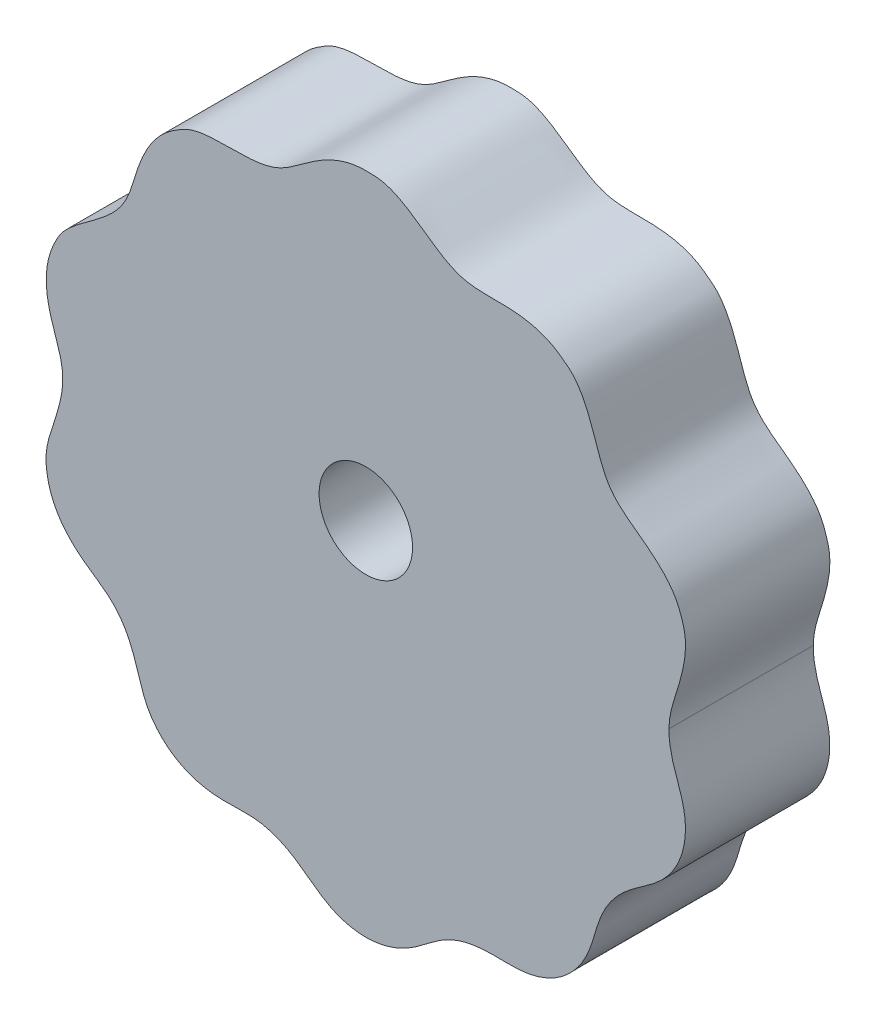
ISO-10303-21;
HEADER;
FILE_DESCRIPTION(('STEP AP214'),'2;1');
FILE_NAME('part.step','',(''),(''),'','','');
FILE_SCHEMA(('AUTOMOTIVE_DESIGN { 1 0 10303 214 1 1 1 1 }'));
ENDSEC;
DATA;
#1=APPLICATION_CONTEXT('core data for automotive mechanical design processes');
#2=APPLICATION_PROTOCOL_DEFINITION('international standard','automotive_design',2000,#1);
#3=PRODUCT_CONTEXT('',#1,'mechanical');
#4=PRODUCT('Part','Part','',(#3));
#5=PRODUCT_RELATED_PRODUCT_CATEGORY('part','',(#4));
#6=PRODUCT_DEFINITION_FORMATION('','',#4);
#7=PRODUCT_DEFINITION_CONTEXT('part definition',#1,'design');
#8=PRODUCT_DEFINITION('design','',#6,#7);
#9=PRODUCT_DEFINITION_SHAPE('','',#8);
#10=(LENGTH_UNIT() NAMED_UNIT(*) SI_UNIT(.MILLI.,.METRE.));
#11=(NAMED_UNIT(*) PLANE_ANGLE_UNIT() SI_UNIT($,.RADIAN.));
#12=(NAMED_UNIT(*) SI_UNIT($,.STERADIAN.) SOLID_ANGLE_UNIT());
#13=UNCERTAINTY_MEASURE_WITH_UNIT(LENGTH_MEASURE(1.E-05),#10,'distance_accuracy_value','');
#14=(GEOMETRIC_REPRESENTATION_CONTEXT(3) GLOBAL_UNCERTAINTY_ASSIGNED_CONTEXT((#13)) GLOBAL_UNIT_ASSIGNED_CONTEXT((#10,
#11,#12)) REPRESENTATION_CONTEXT('',''));
#15=CARTESIAN_POINT('',(0.,0.,0.));
#16=DIRECTION('',(0.,0.,1.));
#17=DIRECTION('',(1.,0.,0.));
#18=AXIS2_PLACEMENT_3D('',#15,#16,#17);
#19=CARTESIAN_POINT('',(10.5000259996595,0.0105000834515226,5.));
#20=CARTESIAN_POINT('',(10.5001048294199,0.0264184257585318,5.));
#21=CARTESIAN_POINT('',(10.5007115661272,0.0582796279955404,5.));
#22=CARTESIAN_POINT('',(10.503009847452,0.114829082964499,5.));
#23=CARTESIAN_POINT('',(10.5087266558851,0.196966447472672,5.));
#24=CARTESIAN_POINT('',(10.5189693942636,0.295241713894375,5.));
#25=CARTESIAN_POINT('',(10.535875912712,0.405252359812212,5.));
#26=CARTESIAN_POINT('',(10.5615068928391,0.534666033656944,5.));
#27=CARTESIAN_POINT('',(10.5970480353222,0.682169537704581,5.));
#28=CARTESIAN_POINT('',(10.637071722356,0.827718674558213,5.));
#29=CARTESIAN_POINT('',(10.6800310026894,0.97266306184544,5.));
#30=CARTESIAN_POINT('',(10.7274445083926,1.12625883134798,5.));
#31=CARTESIAN_POINT('',(10.7783138711307,1.28881359291302,5.));
#32=CARTESIAN_POINT('',(10.8452810600262,1.50605669667608,5.));
#33=CARTESIAN_POINT('',(10.9242169263714,1.77918003825524,5.));
#34=CARTESIAN_POINT('',(11.0034833416908,2.10149422087458,5.));
#35=CARTESIAN_POINT('',(11.059665237364,2.43794782268923,5.));
#36=CARTESIAN_POINT('',(11.0814061704677,2.740126659603,5.));
#37=CARTESIAN_POINT('',(11.0715444647144,3.00431645743637,5.));
#38=CARTESIAN_POINT('',(11.0423259466252,3.20017287851462,5.));
#39=CARTESIAN_POINT('',(10.9983006334228,3.36374619579446,5.));
#40=CARTESIAN_POINT('',(10.9549931989951,3.49969519652166,5.));
#41=CARTESIAN_POINT('',(10.9191141293276,3.61014213598758,5.));
#42=CARTESIAN_POINT('',(10.8715573399689,3.74992435729805,5.));
#43=CARTESIAN_POINT('',(10.8028004066191,3.91560573712742,5.));
#44=CARTESIAN_POINT('',(10.7025185554883,4.09954553117977,5.));
#45=CARTESIAN_POINT('',(10.5461982919032,4.32750446994615,5.));
#46=CARTESIAN_POINT('',(10.343492756728,4.56683822898761,5.));
#47=CARTESIAN_POINT('',(10.0928995847101,4.81252804378833,5.));
#48=CARTESIAN_POINT('',(9.79623736037879,5.06169317549239,5.));
#49=CARTESIAN_POINT('',(9.44621280555743,5.32521972184382,5.));
#50=CARTESIAN_POINT('',(9.05194058110651,5.60997660827454,5.));
#51=CARTESIAN_POINT('',(8.68178364823434,5.91045131674057,5.));
#52=CARTESIAN_POINT('',(8.40105629295879,6.28092654371785,5.));
#53=CARTESIAN_POINT('',(8.22504840437341,6.63668536191203,5.));
#54=CARTESIAN_POINT('',(8.10290343213784,6.94620990886774,5.));
#55=CARTESIAN_POINT('',(7.99258942601259,7.26708747322704,5.));
#56=CARTESIAN_POINT('',(7.88159602819585,7.59488197336541,5.));
#57=CARTESIAN_POINT('',(7.76208429352728,7.92707402768022,5.));
#58=CARTESIAN_POINT('',(7.62370441258603,8.25924599756008,5.));
#59=CARTESIAN_POINT('',(7.47598409902879,8.55008504502753,5.));
#60=CARTESIAN_POINT('',(7.3168917430591,8.79495709800448,5.));
#61=CARTESIAN_POINT('',(7.15075699998367,8.99259012708415,5.));
#62=CARTESIAN_POINT('',(6.98328212768019,9.14111616535054,5.));
#63=CARTESIAN_POINT('',(6.80096352962713,9.27316494508363,5.));
#64=CARTESIAN_POINT('',(6.61833420737676,9.40774236841796,5.));
#65=CARTESIAN_POINT('',(6.3701820366871,9.55199919624496,5.));
#66=CARTESIAN_POINT('',(6.06478435002615,9.67788061936099,5.));
#67=CARTESIAN_POINT('',(5.70529220739258,9.77421376805946,5.));
#68=CARTESIAN_POINT('',(5.19938794061724,9.84948356052572,5.));
#69=CARTESIAN_POINT('',(4.65933461420114,9.87105155349161,5.));
#70=CARTESIAN_POINT('',(4.07890017616407,9.85357197626514,5.));
#71=CARTESIAN_POINT('',(3.50769511887468,9.89146797717838,5.));
#72=CARTESIAN_POINT('',(3.07015388415277,10.0351228728835,5.));
#73=CARTESIAN_POINT('',(2.64233551915355,10.2613039325899,5.));
#74=CARTESIAN_POINT('',(2.21777097691001,10.5479718199286,5.));
#75=CARTESIAN_POINT('',(1.80559691949567,10.8489191657662,5.));
#76=CARTESIAN_POINT('',(1.37847650691224,11.1307221223136,5.));
#77=CARTESIAN_POINT('',(1.02895261922722,11.3143600856933,5.));
#78=CARTESIAN_POINT('',(0.769392125082659,11.4162119904844,5.));
#79=CARTESIAN_POINT('',(0.528662606047067,11.4748601520336,5.));
#80=CARTESIAN_POINT('',(0.34014591995296,11.4923695404451,5.));
#81=CARTESIAN_POINT('',(0.178359512638838,11.4972112806719,5.));
#82=CARTESIAN_POINT('',(-0.0429617310369814,11.5025644788609,5.));
#83=CARTESIAN_POINT('',(-0.324456478072367,11.493701175031,5.));
#84=CARTESIAN_POINT('',(-0.754292044081003,11.4130196976523,5.));
#85=CARTESIAN_POINT('',(-1.30408237440052,11.1953885983105,5.));
#86=CARTESIAN_POINT('',(-1.84510727051435,10.8684126506679,5.));
#87=CARTESIAN_POINT('',(-2.3154214165742,10.5077294014391,5.));
#88=CARTESIAN_POINT('',(-2.71439006190533,10.2221910949529,5.));
#89=CARTESIAN_POINT('',(-3.06142709543121,10.0444128262384,5.));
#90=CARTESIAN_POINT('',(-3.35879856974595,9.94321908037028,5.));
#91=CARTESIAN_POINT('',(-3.74659094320215,9.86644077148835,5.));
#92=CARTESIAN_POINT('',(-4.24547996185479,9.83079361294313,5.));
#93=CARTESIAN_POINT('',(-4.75633773051174,9.83201662349578,5.));
#94=CARTESIAN_POINT('',(-5.27937940035151,9.82646803235608,5.));
#95=CARTESIAN_POINT('',(-5.69625156808816,9.78507082016119,5.));
#96=CARTESIAN_POINT('',(-5.98072232981013,9.72423703691899,5.));
#97=CARTESIAN_POINT('',(-6.21911680480913,9.63688994246106,5.));
#98=CARTESIAN_POINT('',(-6.40980268059581,9.53454116820386,5.));
#99=CARTESIAN_POINT('',(-6.59481071128278,9.41793080804636,5.));
#100=CARTESIAN_POINT('',(-6.7788070713599,9.29439097949949,5.));
#101=CARTESIAN_POINT('',(-6.99845193961731,9.11855241958439,5.));
#102=CARTESIAN_POINT('',(-7.26871376451952,8.8429109964273,5.));
#103=CARTESIAN_POINT('',(-7.55097534046629,8.44438575442727,5.));
#104=CARTESIAN_POINT('',(-7.81120251451606,7.90564614714792,5.));
#105=CARTESIAN_POINT('',(-7.98542568122687,7.36702401313024,5.));
#106=CARTESIAN_POINT('',(-8.12294371754769,6.89574141503751,5.));
#107=CARTESIAN_POINT('',(-8.2995662473298,6.46017283042775,5.));
#108=CARTESIAN_POINT('',(-8.53330223519762,6.08599948661898,5.));
#109=CARTESIAN_POINT('',(-8.84962275404447,5.75571507779687,5.));
#110=CARTESIAN_POINT('',(-9.2127459304404,5.45572406750674,5.));
#111=CARTESIAN_POINT('',(-9.56341476660639,5.19774278715688,5.));
#112=CARTESIAN_POINT('',(-9.88734150413978,4.96454947703263,5.));
#113=CARTESIAN_POINT('',(-10.2046436337999,4.71739597905755,5.));
#114=CARTESIAN_POINT('',(-10.4609987089737,4.47150140369236,5.));
#115=CARTESIAN_POINT('',(-10.6409570911345,4.22261338066336,5.));
#116=CARTESIAN_POINT('',(-10.7625198762939,3.9870138069379,5.));
#117=CARTESIAN_POINT('',(-10.8540650528386,3.78533971053623,5.));
#118=CARTESIAN_POINT('',(-10.9574234358809,3.51536328931377,5.));
#119=CARTESIAN_POINT('',(-11.0466057804634,3.1605986725257,5.));
#120=CARTESIAN_POINT('',(-11.0859429705711,2.72771722316399,5.));
#121=CARTESIAN_POINT('',(-11.0511748216308,2.2533495112549,5.));
#122=CARTESIAN_POINT('',(-10.9584099154489,1.8059065254275,5.));
#123=CARTESIAN_POINT('',(-10.8323356414937,1.39499290777946,5.));
#124=CARTESIAN_POINT('',(-10.6969308729277,1.01511088296022,5.));
#125=CARTESIAN_POINT('',(-10.5654138543342,0.615645480809583,5.));
#126=CARTESIAN_POINT('',(-10.4874586369524,0.181998824013859,5.));
#127=CARTESIAN_POINT('',(-10.5017249670691,-0.379724647290651,5.));
#128=CARTESIAN_POINT('',(-10.6531601083947,-1.04644692357243,5.));
#129=CARTESIAN_POINT('',(-10.8665109647804,-1.62788010629204,5.));
#130=CARTESIAN_POINT('',(-11.0344578293952,-2.16585928512982,5.));
#131=CARTESIAN_POINT('',(-11.0808837998222,-2.56344944229804,5.));
#132=CARTESIAN_POINT('',(-11.0801044342768,-2.79968846902725,5.));
#133=CARTESIAN_POINT('',(-11.0504186502972,-3.09364839956221,5.));
#134=CARTESIAN_POINT('',(-10.9840439591602,-3.44226287640831,5.));
#135=CARTESIAN_POINT('',(-10.848306380665,-3.83136925325631,5.));
#136=CARTESIAN_POINT('',(-10.6193998269797,-4.23881049803247,5.));
#137=CARTESIAN_POINT('',(-10.3410514120845,-4.59155082075995,5.));
#138=CARTESIAN_POINT('',(-10.0316166764077,-4.89206975591219,5.));
#139=CARTESIAN_POINT('',(-9.70400785366773,-5.1498266174014,5.));
#140=CARTESIAN_POINT('',(-9.37220778498275,-5.37803912109795,5.));
#141=CARTESIAN_POINT('',(-9.02915624264273,-5.61373901024372,5.));
#142=CARTESIAN_POINT('',(-8.70189549052895,-5.89614388529793,5.));
#143=CARTESIAN_POINT('',(-8.36819044889937,-6.31601103316079,5.));
#144=CARTESIAN_POINT('',(-8.07978936113426,-6.88823975079273,5.));
#145=CARTESIAN_POINT('',(-7.90541657303611,-7.44559019638691,5.));
#146=CARTESIAN_POINT('',(-7.75542004256456,-7.95456682894558,5.));
#147=CARTESIAN_POINT('',(-7.60272157871748,-8.31234244069944,5.));
#148=CARTESIAN_POINT('',(-7.48485274292157,-8.52870344081869,5.));
#149=CARTESIAN_POINT('',(-7.31473465607675,-8.77520050890113,5.));
#150=CARTESIAN_POINT('',(-7.08419857100512,-9.04231206036892,5.));
#151=CARTESIAN_POINT('',(-6.69171461448847,-9.38661042288974,5.));
#152=CARTESIAN_POINT('',(-6.12732970079235,-9.68591163590114,5.));
#153=CARTESIAN_POINT('',(-5.45023591658135,-9.85482864633477,5.));
#154=CARTESIAN_POINT('',(-4.73482529085109,-9.87289087569385,5.));
#155=CARTESIAN_POINT('',(-4.11593595487789,-9.83076711279388,5.));
#156=CARTESIAN_POINT('',(-3.51908667514989,-9.88516944732904,5.));
#157=CARTESIAN_POINT('',(-2.97491691287754,-10.0649054774183,5.));
#158=CARTESIAN_POINT('',(-2.44557515688871,-10.3541019586843,5.));
#159=CARTESIAN_POINT('',(-1.93885438391421,-10.7311499315236,5.));
#160=CARTESIAN_POINT('',(-1.37354590292759,-11.1697743017267,5.));
#161=CARTESIAN_POINT('',(-0.629008992321922,-11.4829250848612,5.));
#162=CARTESIAN_POINT('',(0.245211841616288,-11.5559245151699,5.));
#163=CARTESIAN_POINT('',(1.11206725264796,-11.3245067890969,5.));
#164=CARTESIAN_POINT('',(1.83402671936433,-10.8829881747148,5.));
#165=CARTESIAN_POINT('',(2.37986416168733,-10.4062875399064,5.));
#166=CARTESIAN_POINT('',(2.90457515845031,-10.0946404728535,5.));
#167=CARTESIAN_POINT('',(3.49117211320051,-9.89596820554772,5.));
#168=CARTESIAN_POINT('',(4.11876534796051,-9.80338954604728,5.));
#169=CARTESIAN_POINT('',(4.74930605962909,-9.829396226919,5.));
#170=CARTESIAN_POINT('',(5.38229403379887,-9.83313511436207,5.));
#171=CARTESIAN_POINT('',(5.92168923219119,-9.7278437683662,5.));
#172=CARTESIAN_POINT('',(6.35413654265242,-9.56537408644923,5.));
#173=CARTESIAN_POINT('',(6.86573086261321,-9.26171742902622,5.));
#174=CARTESIAN_POINT('',(7.27890111917769,-8.86111406524538,5.));
#175=CARTESIAN_POINT('',(7.5813752234123,-8.39929632658292,5.));
#176=CARTESIAN_POINT('',(7.78467509618198,-7.91479490993791,5.));
#177=CARTESIAN_POINT('',(7.8970874527581,-7.56153358981202,5.));
#178=CARTESIAN_POINT('',(8.00711411353118,-7.16643871560516,5.));
#179=CARTESIAN_POINT('',(8.1533795000661,-6.73982462484788,5.));
#180=CARTESIAN_POINT('',(8.39610033246734,-6.27314254916155,5.));
#181=CARTESIAN_POINT('',(8.77169404772501,-5.80595336710727,5.));
#182=CARTESIAN_POINT('',(9.25314422153011,-5.39936208435424,5.));
#183=CARTESIAN_POINT('',(9.80579363599765,-5.04469075652925,5.));
#184=CARTESIAN_POINT('',(10.2889400003648,-4.65797891269276,5.));
#185=CARTESIAN_POINT('',(10.650092312287,-4.20542427395497,5.));
#186=CARTESIAN_POINT('',(10.8944344794551,-3.72812650933997,5.));
#187=CARTESIAN_POINT('',(11.0354291688477,-3.2514203366136,5.));
#188=CARTESIAN_POINT('',(11.0843024192694,-2.79427661401115,5.));
#189=CARTESIAN_POINT('',(11.0606530006441,-2.37192664674445,5.));
#190=CARTESIAN_POINT('',(10.9875285819416,-1.99342066414433,5.));
#191=CARTESIAN_POINT('',(10.9000475752562,-1.70082183745389,5.));
#192=CARTESIAN_POINT('',(10.8136589831162,-1.45422268609148,5.));
#193=CARTESIAN_POINT('',(10.7431701780615,-1.25479087986251,5.));
#194=CARTESIAN_POINT('',(10.6913482419793,-1.10176818552672,5.));
#195=CARTESIAN_POINT('',(10.6451900880009,-0.95351394516553,5.));
#196=CARTESIAN_POINT('',(10.6054107183801,-0.810029760826601,5.));
#197=CARTESIAN_POINT('',(10.5710639363577,-0.665080630960173,5.));
#198=CARTESIAN_POINT('',(10.5428522290195,-0.519055196821209,5.));
#199=CARTESIAN_POINT('',(10.521287099145,-0.369796581525494,5.));
#200=CARTESIAN_POINT('',(10.5067243799115,-0.231657261759564,5.));
#201=CARTESIAN_POINT('',(10.5012226113992,-0.0928702614832248,5.));
#202=CARTESIAN_POINT('',(10.500000000005,-0.0313625493271181,5.));
#203=CARTESIAN_POINT('',(10.5,0.,5.));
#204=B_SPLINE_CURVE_WITH_KNOTS('',4,(#19,#20,#21,#22,#23,#24,#25,#26,#27,#28,#29,#30,#31,#32,
#33,#34,#35,#36,#37,#38,#39,#40,#41,#42,#43,#44,#45,#46,#47,#48,#49,#50,#51,#52,#53,#54,#55,#56,
#57,#58,#59,#60,#61,#62,#63,#64,#65,#66,#67,#68,#69,#70,#71,#72,#73,#74,#75,#76,#77,#78,#79,#80,
#81,#82,#83,#84,#85,#86,#87,#88,#89,#90,#91,#92,#93,#94,#95,#96,#97,#98,#99,#100,#101,#102,#103,
#104,#105,#106,#107,#108,#109,#110,#111,#112,#113,#114,#115,#116,#117,#118,#119,#120,#121,#122,
#123,#124,#125,#126,#127,#128,#129,#130,#131,#132,#133,#134,#135,#136,#137,#138,#139,#140,#141,
#142,#143,#144,#145,#146,#147,#148,#149,#150,#151,#152,#153,#154,#155,#156,#157,#158,#159,#160,
#161,#162,#163,#164,#165,#166,#167,#168,#169,#170,#171,#172,#173,#174,#175,#176,#177,#178,#179,
#180,#181,#182,#183,#184,#185,#186,#187,#188,#189,#190,#191,#192,#193,#194,#195,#196,#197,#198,
#199,#200,#201,#202,#203),.UNSPECIFIED.,.F.,.F.,(5,1,1,1,1,1,1,1,1,1,1,1,1,1,1,1,1,1,1,1,1,1,1,
1,1,1,1,1,1,1,1,1,1,1,1,1,1,1,1,1,1,1,1,1,1,1,1,1,1,1,1,1,1,1,1,1,1,1,1,1,1,1,1,1,1,1,1,1,1,1,1,
1,1,1,1,1,1,1,1,1,1,1,1,1,1,1,1,1,1,1,1,1,1,1,1,1,1,1,1,1,1,1,1,1,1,1,1,1,1,1,1,1,1,1,1,1,1,1,1,
1,1,1,1,1,1,1,1,1,1,1,1,1,1,1,1,1,1,1,1,1,1,1,1,1,1,1,1,1,1,1,1,1,1,1,1,1,1,1,1,1,1,1,1,1,1,1,1,
1,1,1,1,1,1,1,1,1,1,1,1,1,1,5),(0.0793096471965865,0.0801840078519034,0.0810583685072204,
0.0819327291625374,0.0828070898178544,0.0845558111284884,0.0863045324391222,0.0880532537497561,
0.08980197506039,0.091550696371024,0.0932994176816579,0.0954922862449255,0.097685154808193,
0.102070891934728,0.106456629061263,0.110842366187798,0.1134528665288,0.116063366869802,
0.118673867210805,0.119979117381306,0.121284367551807,0.122666170803665,0.124047974055523,
0.126811580559239,0.129575187062956,0.132338793566672,0.136821690238761,0.141304586910849,
0.145787483582938,0.150270380255026,0.157068298119175,0.163866215983324,0.167713182045455,
0.171560148107586,0.175407114169717,0.179254080231848,0.183416060455022,0.187578040678196,
0.19174002090137,0.195902001124544,0.198484694416269,0.201067387707995,0.203650080999721,
0.206232774291446,0.208898704840493,0.211564635389539,0.216896496487632,0.221477990084626,
0.226059483681619,0.235222470875606,0.241823189006553,0.248423907137499,0.252369343388726,
0.256314779639952,0.264205652142405,0.272081186187557,0.276018953210133,0.279956720232708,
0.282453785675091,0.284950851117474,0.287447916559857,0.288696449281048,0.289944982002239,
0.29519902196316,0.30045306192408,0.308810020919703,0.317166979915325,0.324322238053648,
0.327899867122809,0.33147749619197,0.335145691590727,0.338813886989483,0.346150277786996,
0.354579479440329,0.358794080266995,0.363008681093661,0.365507178533993,0.368005675974324,
0.370504173414655,0.373002670854987,0.375629068898513,0.378255466942039,0.383508263029091,
0.390809411087853,0.398110559146615,0.405820466801723,0.409675420629276,0.41353037445683,
0.419811047176839,0.426091719896848,0.430710159306556,0.435328598716264,0.439947038125972,
0.44456547753568,0.449320342187237,0.451697774513016,0.454075206838794,0.456821901527323,
0.459568596215852,0.465061985592909,0.470947020399799,0.47683205520669,0.481497332532875,
0.486162609859061,0.490827887185247,0.495493164511433,0.500956919380529,0.506420674249625,
0.516680840291959,0.526941006334293,0.529671413407083,0.532401820479873,0.535132227552664,
0.537862634625454,0.543328067790379,0.548793500955304,0.554093022828657,0.55939254470201,
0.564050002710673,0.568707460719335,0.573364918727998,0.578022376736661,0.583319705602784,
0.588617034468908,0.598042827583762,0.607468620698616,0.610315284520545,0.613161948342474,
0.616008612164403,0.618855275986332,0.624153882704927,0.629452489423521,0.640052642610628,
0.648073718245131,0.656094793879635,0.662434429523122,0.668774065166609,0.675597492173606,
0.682420919180603,0.690216423426888,0.698011927673173,0.708607382503868,0.719206807237305,
0.730043259074116,0.738735856846142,0.747428454618168,0.752729675019228,0.758030895420288,
0.767294888712387,0.776558882004487,0.781908844121373,0.787258806238259,0.792559144685614,
0.797859483132969,0.809288293719841,0.813572906191479,0.817857518663117,0.822142131134755,
0.826426743606393,0.832560485571829,0.838694227537266,0.846342809438349,0.853991391339431,
0.861551631881865,0.8691118724243,0.874826493973346,0.880541115522393,0.88625545251835,
0.891969789514307,0.896002035658355,0.900034281802403,0.90406652794645,0.906082651018475,
0.908098774090498,0.909821431018298,0.911544087946097,0.913266744873896,0.914989401801695,
0.916712058729494,0.918434715657293,0.920157372585092,0.921880029512891),.UNSPECIFIED.);
#205=DIRECTION('',(0.,0.,-1.));
#206=VECTOR('',#205,1.);
#207=SURFACE_OF_LINEAR_EXTRUSION('',#204,#206);
#208=CARTESIAN_POINT('',(10.5000259996595,0.0105000834515226,0.));
#209=CARTESIAN_POINT('',(10.5001048294199,0.0264184257585318,0.));
#210=CARTESIAN_POINT('',(10.5007115661272,0.0582796279955404,0.));
#211=CARTESIAN_POINT('',(10.503009847452,0.114829082964499,0.));
#212=CARTESIAN_POINT('',(10.5087266558851,0.196966447472672,0.));
#213=CARTESIAN_POINT('',(10.5189693942636,0.295241713894375,0.));
#214=CARTESIAN_POINT('',(10.535875912712,0.405252359812212,0.));
#215=CARTESIAN_POINT('',(10.5615068928391,0.534666033656944,0.));
#216=CARTESIAN_POINT('',(10.5970480353222,0.682169537704581,0.));
#217=CARTESIAN_POINT('',(10.637071722356,0.827718674558213,0.));
#218=CARTESIAN_POINT('',(10.6800310026894,0.97266306184544,0.));
#219=CARTESIAN_POINT('',(10.7274445083926,1.12625883134798,0.));
#220=CARTESIAN_POINT('',(10.7783138711307,1.28881359291302,0.));
#221=CARTESIAN_POINT('',(10.8452810600262,1.50605669667608,0.));
#222=CARTESIAN_POINT('',(10.9242169263714,1.77918003825524,0.));
#223=CARTESIAN_POINT('',(11.0034833416908,2.10149422087458,0.));
#224=CARTESIAN_POINT('',(11.059665237364,2.43794782268923,0.));
#225=CARTESIAN_POINT('',(11.0814061704677,2.740126659603,0.));
#226=CARTESIAN_POINT('',(11.0715444647144,3.00431645743637,0.));
#227=CARTESIAN_POINT('',(11.0423259466252,3.20017287851462,0.));
#228=CARTESIAN_POINT('',(10.9983006334228,3.36374619579446,0.));
#229=CARTESIAN_POINT('',(10.9549931989951,3.49969519652166,0.));
#230=CARTESIAN_POINT('',(10.9191141293276,3.61014213598758,0.));
#231=CARTESIAN_POINT('',(10.8715573399689,3.74992435729805,0.));
#232=CARTESIAN_POINT('',(10.8028004066191,3.91560573712742,0.));
#233=CARTESIAN_POINT('',(10.7025185554883,4.09954553117977,0.));
#234=CARTESIAN_POINT('',(10.5461982919032,4.32750446994615,0.));
#235=CARTESIAN_POINT('',(10.343492756728,4.56683822898761,0.));
#236=CARTESIAN_POINT('',(10.0928995847101,4.81252804378833,0.));
#237=CARTESIAN_POINT('',(9.79623736037879,5.06169317549239,0.));
#238=CARTESIAN_POINT('',(9.44621280555743,5.32521972184382,0.));
#239=CARTESIAN_POINT('',(9.05194058110651,5.60997660827454,0.));
#240=CARTESIAN_POINT('',(8.68178364823434,5.91045131674057,0.));
#241=CARTESIAN_POINT('',(8.40105629295879,6.28092654371785,0.));
#242=CARTESIAN_POINT('',(8.22504840437341,6.63668536191203,0.));
#243=CARTESIAN_POINT('',(8.10290343213784,6.94620990886774,0.));
#244=CARTESIAN_POINT('',(7.99258942601259,7.26708747322704,0.));
#245=CARTESIAN_POINT('',(7.88159602819585,7.59488197336541,0.));
#246=CARTESIAN_POINT('',(7.76208429352728,7.92707402768022,0.));
#247=CARTESIAN_POINT('',(7.62370441258603,8.25924599756008,0.));
#248=CARTESIAN_POINT('',(7.47598409902879,8.55008504502753,0.));
#249=CARTESIAN_POINT('',(7.3168917430591,8.79495709800448,0.));
#250=CARTESIAN_POINT('',(7.15075699998367,8.99259012708415,0.));
#251=CARTESIAN_POINT('',(6.98328212768019,9.14111616535054,0.));
#252=CARTESIAN_POINT('',(6.80096352962713,9.27316494508363,0.));
#253=CARTESIAN_POINT('',(6.61833420737676,9.40774236841796,0.));
#254=CARTESIAN_POINT('',(6.3701820366871,9.55199919624496,0.));
#255=CARTESIAN_POINT('',(6.06478435002615,9.67788061936099,0.));
#256=CARTESIAN_POINT('',(5.70529220739258,9.77421376805946,0.));
#257=CARTESIAN_POINT('',(5.19938794061724,9.84948356052572,0.));
#258=CARTESIAN_POINT('',(4.65933461420114,9.87105155349161,0.));
#259=CARTESIAN_POINT('',(4.07890017616407,9.85357197626514,0.));
#260=CARTESIAN_POINT('',(3.50769511887468,9.89146797717838,0.));
#261=CARTESIAN_POINT('',(3.07015388415277,10.0351228728835,0.));
#262=CARTESIAN_POINT('',(2.64233551915355,10.2613039325899,0.));
#263=CARTESIAN_POINT('',(2.21777097691001,10.5479718199286,0.));
#264=CARTESIAN_POINT('',(1.80559691949567,10.8489191657662,0.));
#265=CARTESIAN_POINT('',(1.37847650691224,11.1307221223136,0.));
#266=CARTESIAN_POINT('',(1.02895261922722,11.3143600856933,0.));
#267=CARTESIAN_POINT('',(0.769392125082659,11.4162119904844,0.));
#268=CARTESIAN_POINT('',(0.528662606047067,11.4748601520336,0.));
#269=CARTESIAN_POINT('',(0.34014591995296,11.4923695404451,0.));
#270=CARTESIAN_POINT('',(0.178359512638838,11.4972112806719,0.));
#271=CARTESIAN_POINT('',(-0.0429617310369814,11.5025644788609,0.));
#272=CARTESIAN_POINT('',(-0.324456478072367,11.493701175031,0.));
#273=CARTESIAN_POINT('',(-0.754292044081003,11.4130196976523,0.));
#274=CARTESIAN_POINT('',(-1.30408237440052,11.1953885983105,0.));
#275=CARTESIAN_POINT('',(-1.84510727051435,10.8684126506679,0.));
#276=CARTESIAN_POINT('',(-2.3154214165742,10.5077294014391,0.));
#277=CARTESIAN_POINT('',(-2.71439006190533,10.2221910949529,0.));
#278=CARTESIAN_POINT('',(-3.06142709543121,10.0444128262384,0.));
#279=CARTESIAN_POINT('',(-3.35879856974595,9.94321908037028,0.));
#280=CARTESIAN_POINT('',(-3.74659094320215,9.86644077148835,0.));
#281=CARTESIAN_POINT('',(-4.24547996185479,9.83079361294313,0.));
#282=CARTESIAN_POINT('',(-4.75633773051174,9.83201662349578,0.));
#283=CARTESIAN_POINT('',(-5.27937940035151,9.82646803235608,0.));
#284=CARTESIAN_POINT('',(-5.69625156808816,9.78507082016119,0.));
#285=CARTESIAN_POINT('',(-5.98072232981013,9.72423703691899,0.));
#286=CARTESIAN_POINT('',(-6.21911680480913,9.63688994246106,0.));
#287=CARTESIAN_POINT('',(-6.40980268059581,9.53454116820386,0.));
#288=CARTESIAN_POINT('',(-6.59481071128278,9.41793080804636,0.));
#289=CARTESIAN_POINT('',(-6.7788070713599,9.29439097949949,0.));
#290=CARTESIAN_POINT('',(-6.99845193961731,9.11855241958439,0.));
#291=CARTESIAN_POINT('',(-7.26871376451952,8.8429109964273,0.));
#292=CARTESIAN_POINT('',(-7.55097534046629,8.44438575442727,0.));
#293=CARTESIAN_POINT('',(-7.81120251451606,7.90564614714792,0.));
#294=CARTESIAN_POINT('',(-7.98542568122687,7.36702401313024,0.));
#295=CARTESIAN_POINT('',(-8.12294371754769,6.89574141503751,0.));
#296=CARTESIAN_POINT('',(-8.2995662473298,6.46017283042775,0.));
#297=CARTESIAN_POINT('',(-8.53330223519762,6.08599948661898,0.));
#298=CARTESIAN_POINT('',(-8.84962275404447,5.75571507779687,0.));
#299=CARTESIAN_POINT('',(-9.2127459304404,5.45572406750674,0.));
#300=CARTESIAN_POINT('',(-9.56341476660639,5.19774278715688,0.));
#301=CARTESIAN_POINT('',(-9.88734150413978,4.96454947703263,0.));
#302=CARTESIAN_POINT('',(-10.2046436337999,4.71739597905755,0.));
#303=CARTESIAN_POINT('',(-10.4609987089737,4.47150140369236,0.));
#304=CARTESIAN_POINT('',(-10.6409570911345,4.22261338066336,0.));
#305=CARTESIAN_POINT('',(-10.7625198762939,3.9870138069379,0.));
#306=CARTESIAN_POINT('',(-10.8540650528386,3.78533971053623,0.));
#307=CARTESIAN_POINT('',(-10.9574234358809,3.51536328931377,0.));
#308=CARTESIAN_POINT('',(-11.0466057804634,3.1605986725257,0.));
#309=CARTESIAN_POINT('',(-11.0859429705711,2.72771722316399,0.));
#310=CARTESIAN_POINT('',(-11.0511748216308,2.2533495112549,0.));
#311=CARTESIAN_POINT('',(-10.9584099154489,1.8059065254275,0.));
#312=CARTESIAN_POINT('',(-10.8323356414937,1.39499290777946,0.));
#313=CARTESIAN_POINT('',(-10.6969308729277,1.01511088296022,0.));
#314=CARTESIAN_POINT('',(-10.5654138543342,0.615645480809583,0.));
#315=CARTESIAN_POINT('',(-10.4874586369524,0.181998824013859,0.));
#316=CARTESIAN_POINT('',(-10.5017249670691,-0.379724647290651,0.));
#317=CARTESIAN_POINT('',(-10.6531601083947,-1.04644692357243,0.));
#318=CARTESIAN_POINT('',(-10.8665109647804,-1.62788010629204,0.));
#319=CARTESIAN_POINT('',(-11.0344578293952,-2.16585928512982,0.));
#320=CARTESIAN_POINT('',(-11.0808837998222,-2.56344944229804,0.));
#321=CARTESIAN_POINT('',(-11.0801044342768,-2.79968846902725,0.));
#322=CARTESIAN_POINT('',(-11.0504186502972,-3.09364839956221,0.));
#323=CARTESIAN_POINT('',(-10.9840439591602,-3.44226287640831,0.));
#324=CARTESIAN_POINT('',(-10.848306380665,-3.83136925325631,0.));
#325=CARTESIAN_POINT('',(-10.6193998269797,-4.23881049803247,0.));
#326=CARTESIAN_POINT('',(-10.3410514120845,-4.59155082075995,0.));
#327=CARTESIAN_POINT('',(-10.0316166764077,-4.89206975591219,0.));
#328=CARTESIAN_POINT('',(-9.70400785366773,-5.1498266174014,0.));
#329=CARTESIAN_POINT('',(-9.37220778498275,-5.37803912109795,0.));
#330=CARTESIAN_POINT('',(-9.02915624264273,-5.61373901024372,0.));
#331=CARTESIAN_POINT('',(-8.70189549052895,-5.89614388529793,0.));
#332=CARTESIAN_POINT('',(-8.36819044889937,-6.31601103316079,0.));
#333=CARTESIAN_POINT('',(-8.07978936113426,-6.88823975079273,0.));
#334=CARTESIAN_POINT('',(-7.90541657303611,-7.44559019638691,0.));
#335=CARTESIAN_POINT('',(-7.75542004256456,-7.95456682894558,0.));
#336=CARTESIAN_POINT('',(-7.60272157871748,-8.31234244069944,0.));
#337=CARTESIAN_POINT('',(-7.48485274292157,-8.52870344081869,0.));
#338=CARTESIAN_POINT('',(-7.31473465607675,-8.77520050890113,0.));
#339=CARTESIAN_POINT('',(-7.08419857100512,-9.04231206036892,0.));
#340=CARTESIAN_POINT('',(-6.69171461448847,-9.38661042288974,0.));
#341=CARTESIAN_POINT('',(-6.12732970079235,-9.68591163590114,0.));
#342=CARTESIAN_POINT('',(-5.45023591658135,-9.85482864633477,0.));
#343=CARTESIAN_POINT('',(-4.73482529085109,-9.87289087569385,0.));
#344=CARTESIAN_POINT('',(-4.11593595487789,-9.83076711279388,0.));
#345=CARTESIAN_POINT('',(-3.51908667514989,-9.88516944732904,0.));
#346=CARTESIAN_POINT('',(-2.97491691287754,-10.0649054774183,0.));
#347=CARTESIAN_POINT('',(-2.44557515688871,-10.3541019586843,0.));
#348=CARTESIAN_POINT('',(-1.93885438391421,-10.7311499315236,0.));
#349=CARTESIAN_POINT('',(-1.37354590292759,-11.1697743017267,0.));
#350=CARTESIAN_POINT('',(-0.629008992321922,-11.4829250848612,0.));
#351=CARTESIAN_POINT('',(0.245211841616288,-11.5559245151699,0.));
#352=CARTESIAN_POINT('',(1.11206725264796,-11.3245067890969,0.));
#353=CARTESIAN_POINT('',(1.83402671936433,-10.8829881747148,0.));
#354=CARTESIAN_POINT('',(2.37986416168733,-10.4062875399064,0.));
#355=CARTESIAN_POINT('',(2.90457515845031,-10.0946404728535,0.));
#356=CARTESIAN_POINT('',(3.49117211320051,-9.89596820554772,0.));
#357=CARTESIAN_POINT('',(4.11876534796051,-9.80338954604728,0.));
#358=CARTESIAN_POINT('',(4.74930605962909,-9.829396226919,0.));
#359=CARTESIAN_POINT('',(5.38229403379887,-9.83313511436207,0.));
#360=CARTESIAN_POINT('',(5.92168923219119,-9.7278437683662,0.));
#361=CARTESIAN_POINT('',(6.35413654265242,-9.56537408644923,0.));
#362=CARTESIAN_POINT('',(6.86573086261321,-9.26171742902622,0.));
#363=CARTESIAN_POINT('',(7.27890111917769,-8.86111406524538,0.));
#364=CARTESIAN_POINT('',(7.5813752234123,-8.39929632658292,0.));
#365=CARTESIAN_POINT('',(7.78467509618198,-7.91479490993791,0.));
#366=CARTESIAN_POINT('',(7.8970874527581,-7.56153358981202,0.));
#367=CARTESIAN_POINT('',(8.00711411353118,-7.16643871560516,0.));
#368=CARTESIAN_POINT('',(8.1533795000661,-6.73982462484788,0.));
#369=CARTESIAN_POINT('',(8.39610033246734,-6.27314254916155,0.));
#370=CARTESIAN_POINT('',(8.77169404772501,-5.80595336710727,0.));
#371=CARTESIAN_POINT('',(9.25314422153011,-5.39936208435424,0.));
#372=CARTESIAN_POINT('',(9.80579363599765,-5.04469075652925,0.));
#373=CARTESIAN_POINT('',(10.2889400003648,-4.65797891269276,0.));
#374=CARTESIAN_POINT('',(10.650092312287,-4.20542427395497,0.));
#375=CARTESIAN_POINT('',(10.8944344794551,-3.72812650933997,0.));
#376=CARTESIAN_POINT('',(11.0354291688477,-3.2514203366136,0.));
#377=CARTESIAN_POINT('',(11.0843024192694,-2.79427661401115,0.));
#378=CARTESIAN_POINT('',(11.0606530006441,-2.37192664674445,0.));
#379=CARTESIAN_POINT('',(10.9875285819416,-1.99342066414433,0.));
#380=CARTESIAN_POINT('',(10.9000475752562,-1.70082183745389,0.));
#381=CARTESIAN_POINT('',(10.8136589831162,-1.45422268609148,0.));
#382=CARTESIAN_POINT('',(10.7431701780615,-1.25479087986251,0.));
#383=CARTESIAN_POINT('',(10.6913482419793,-1.10176818552672,0.));
#384=CARTESIAN_POINT('',(10.6451900880009,-0.95351394516553,0.));
#385=CARTESIAN_POINT('',(10.6054107183801,-0.810029760826601,0.));
#386=CARTESIAN_POINT('',(10.5710639363577,-0.665080630960173,0.));
#387=CARTESIAN_POINT('',(10.5428522290195,-0.519055196821209,0.));
#388=CARTESIAN_POINT('',(10.521287099145,-0.369796581525494,0.));
#389=CARTESIAN_POINT('',(10.5067243799115,-0.231657261759564,0.));
#390=CARTESIAN_POINT('',(10.5012226113992,-0.0928702614832248,0.));
#391=CARTESIAN_POINT('',(10.500000000005,-0.0313625493271181,0.));
#392=CARTESIAN_POINT('',(10.5,0.,0.));
#393=B_SPLINE_CURVE_WITH_KNOTS('',4,(#208,#209,#210,#211,#212,#213,#214,#215,#216,#217,#218,
#219,#220,#221,#222,#223,#224,#225,#226,#227,#228,#229,#230,#231,#232,#233,#234,#235,#236,#237,
#238,#239,#240,#241,#242,#243,#244,#245,#246,#247,#248,#249,#250,#251,#252,#253,#254,#255,#256,
#257,#258,#259,#260,#261,#262,#263,#264,#265,#266,#267,#268,#269,#270,#271,#272,#273,#274,#275,
#276,#277,#278,#279,#280,#281,#282,#283,#284,#285,#286,#287,#288,#289,#290,#291,#292,#293,#294,
#295,#296,#297,#298,#299,#300,#301,#302,#303,#304,#305,#306,#307,#308,#309,#310,#311,#312,#313,
#314,#315,#316,#317,#318,#319,#320,#321,#322,#323,#324,#325,#326,#327,#328,#329,#330,#331,#332,
#333,#334,#335,#336,#337,#338,#339,#340,#341,#342,#343,#344,#345,#346,#347,#348,#349,#350,#351,
#352,#353,#354,#355,#356,#357,#358,#359,#360,#361,#362,#363,#364,#365,#366,#367,#368,#369,#370,
#371,#372,#373,#374,#375,#376,#377,#378,#379,#380,#381,#382,#383,#384,#385,#386,#387,#388,#389,
#390,#391,#392),.UNSPECIFIED.,.F.,.F.,(5,1,1,1,1,1,1,1,1,1,1,1,1,1,1,1,1,1,1,1,1,1,1,1,1,1,1,1,
1,1,1,1,1,1,1,1,1,1,1,1,1,1,1,1,1,1,1,1,1,1,1,1,1,1,1,1,1,1,1,1,1,1,1,1,1,1,1,1,1,1,1,1,1,1,1,1,
1,1,1,1,1,1,1,1,1,1,1,1,1,1,1,1,1,1,1,1,1,1,1,1,1,1,1,1,1,1,1,1,1,1,1,1,1,1,1,1,1,1,1,1,1,1,1,1,
1,1,1,1,1,1,1,1,1,1,1,1,1,1,1,1,1,1,1,1,1,1,1,1,1,1,1,1,1,1,1,1,1,1,1,1,1,1,1,1,1,1,1,1,1,1,1,1,
1,1,1,1,1,1,1,1,1,5),(0.0793096471965865,0.0801840078519034,0.0810583685072204,
0.0819327291625374,0.0828070898178544,0.0845558111284884,0.0863045324391222,0.0880532537497561,
0.08980197506039,0.091550696371024,0.0932994176816579,0.0954922862449255,0.097685154808193,
0.102070891934728,0.106456629061263,0.110842366187798,0.1134528665288,0.116063366869802,
0.118673867210805,0.119979117381306,0.121284367551807,0.122666170803665,0.124047974055523,
0.126811580559239,0.129575187062956,0.132338793566672,0.136821690238761,0.141304586910849,
0.145787483582938,0.150270380255026,0.157068298119175,0.163866215983324,0.167713182045455,
0.171560148107586,0.175407114169717,0.179254080231848,0.183416060455022,0.187578040678196,
0.19174002090137,0.195902001124544,0.198484694416269,0.201067387707995,0.203650080999721,
0.206232774291446,0.208898704840493,0.211564635389539,0.216896496487632,0.221477990084626,
0.226059483681619,0.235222470875606,0.241823189006553,0.248423907137499,0.252369343388726,
0.256314779639952,0.264205652142405,0.272081186187557,0.276018953210133,0.279956720232708,
0.282453785675091,0.284950851117474,0.287447916559857,0.288696449281048,0.289944982002239,
0.29519902196316,0.30045306192408,0.308810020919703,0.317166979915325,0.324322238053648,
0.327899867122809,0.33147749619197,0.335145691590727,0.338813886989483,0.346150277786996,
0.354579479440329,0.358794080266995,0.363008681093661,0.365507178533993,0.368005675974324,
0.370504173414655,0.373002670854987,0.375629068898513,0.378255466942039,0.383508263029091,
0.390809411087853,0.398110559146615,0.405820466801723,0.409675420629276,0.41353037445683,
0.419811047176839,0.426091719896848,0.430710159306556,0.435328598716264,0.439947038125972,
0.44456547753568,0.449320342187237,0.451697774513016,0.454075206838794,0.456821901527323,
0.459568596215852,0.465061985592909,0.470947020399799,0.47683205520669,0.481497332532875,
0.486162609859061,0.490827887185247,0.495493164511433,0.500956919380529,0.506420674249625,
0.516680840291959,0.526941006334293,0.529671413407083,0.532401820479873,0.535132227552664,
0.537862634625454,0.543328067790379,0.548793500955304,0.554093022828657,0.55939254470201,
0.564050002710673,0.568707460719335,0.573364918727998,0.578022376736661,0.583319705602784,
0.588617034468908,0.598042827583762,0.607468620698616,0.610315284520545,0.613161948342474,
0.616008612164403,0.618855275986332,0.624153882704927,0.629452489423521,0.640052642610628,
0.648073718245131,0.656094793879635,0.662434429523122,0.668774065166609,0.675597492173606,
0.682420919180603,0.690216423426888,0.698011927673173,0.708607382503868,0.719206807237305,
0.730043259074116,0.738735856846142,0.747428454618168,0.752729675019228,0.758030895420288,
0.767294888712387,0.776558882004487,0.781908844121373,0.787258806238259,0.792559144685614,
0.797859483132969,0.809288293719841,0.813572906191479,0.817857518663117,0.822142131134755,
0.826426743606393,0.832560485571829,0.838694227537266,0.846342809438349,0.853991391339431,
0.861551631881865,0.8691118724243,0.874826493973346,0.880541115522393,0.88625545251835,
0.891969789514307,0.896002035658355,0.900034281802403,0.90406652794645,0.906082651018475,
0.908098774090498,0.909821431018298,0.911544087946097,0.913266744873896,0.914989401801695,
0.916712058729494,0.918434715657293,0.920157372585092,0.921880029512891),.UNSPECIFIED.);
#394=CARTESIAN_POINT('',(10.500025999657,0.0105000831159266,0.));
#395=VERTEX_POINT('',#394);
#396=CARTESIAN_POINT('',(10.5,0.,0.));
#397=VERTEX_POINT('',#396);
#398=EDGE_CURVE('E67',#395,#397,#393,.T.);
#399=ORIENTED_EDGE('',*,*,#398,.T.);
#400=DIRECTION('',(0.,0.,-1.));
#401=VECTOR('',#400,1.);
#402=CARTESIAN_POINT('',(10.5,0.,5.));
#403=LINE('',#402,#401);
#404=CARTESIAN_POINT('',(10.5,0.,5.));
#405=VERTEX_POINT('',#404);
#406=EDGE_CURVE('E11',#405,#397,#403,.T.);
#407=ORIENTED_EDGE('',*,*,#406,.F.);
#408=CARTESIAN_POINT('',(10.500025999657,0.0105000831159266,5.));
#409=VERTEX_POINT('',#408);
#410=EDGE_CURVE('E66',#409,#405,#204,.T.);
#411=ORIENTED_EDGE('',*,*,#410,.F.);
#412=DIRECTION('',(0.,0.,-1.));
#413=VECTOR('',#412,1.);
#414=CARTESIAN_POINT('',(10.500025999657,0.0105000831159266,5.));
#415=LINE('',#414,#413);
#416=EDGE_CURVE('E44',#409,#395,#415,.T.);
#417=ORIENTED_EDGE('',*,*,#416,.T.);
#418=EDGE_LOOP('',(#399,#407,#411,#417));
#419=FACE_BOUND('',#418,.T.);
#420=ADVANCED_FACE('F35',(#419),#207,.F.);
#421=CARTESIAN_POINT('',(12.6202666412999,5.06850982552333E-10,5.));
#422=DIRECTION('',(0.,0.,-1.));
#423=DIRECTION('',(-1.,0.,0.));
#424=AXIS2_PLACEMENT_3D('',#421,#422,#423);
#425=CYLINDRICAL_SURFACE('',#424,2.12026664129992);
#426=CARTESIAN_POINT('',(12.6202666412999,5.06850982552333E-10,0.));
#427=DIRECTION('',(0.,0.,-1.));
#428=DIRECTION('',(1.,0.,0.));
#429=AXIS2_PLACEMENT_3D('',#426,#427,#428);
#430=CIRCLE('',#429,2.12026664129992);
#431=EDGE_CURVE('E59',#397,#395,#430,.T.);
#432=ORIENTED_EDGE('',*,*,#431,.T.);
#433=ORIENTED_EDGE('',*,*,#416,.F.);
#434=CARTESIAN_POINT('',(12.6202666412999,5.06850982552333E-10,5.));
#435=DIRECTION('',(0.,0.,-1.));
#436=DIRECTION('',(1.,0.,0.));
#437=AXIS2_PLACEMENT_3D('',#434,#435,#436);
#438=CIRCLE('',#437,2.12026664129992);
#439=EDGE_CURVE('E51',#405,#409,#438,.T.);
#440=ORIENTED_EDGE('',*,*,#439,.F.);
#441=ORIENTED_EDGE('',*,*,#406,.T.);
#442=EDGE_LOOP('',(#432,#433,#440,#441));
#443=FACE_BOUND('',#442,.T.);
#444=ADVANCED_FACE('F62',(#443),#425,.F.);
#445=CARTESIAN_POINT('',(-10.4999761405256,-0.00672816831177761,5.));
#446=DIRECTION('',(0.,0.,-1.));
#447=DIRECTION('',(-1.,0.,0.));
#448=AXIS2_PLACEMENT_3D('',#445,#446,#447);
#449=PLANE('',#448);
#450=CARTESIAN_POINT('',(0.,1.,5.));
#451=DIRECTION('',(0.,0.,1.));
#452=DIRECTION('',(1.,0.,0.));
#453=AXIS2_PLACEMENT_3D('',#450,#451,#452);
#454=CIRCLE('',#453,1.61884403316594);
#455=CARTESIAN_POINT('',(1.61884403316594,1.,5.));
#456=VERTEX_POINT('',#455);
#457=EDGE_CURVE('E74',#456,#456,#454,.T.);
#458=ORIENTED_EDGE('',*,*,#457,.F.);
#459=EDGE_LOOP('',(#458));
#460=FACE_BOUND('',#459,.T.);
#461=ORIENTED_EDGE('',*,*,#410,.T.);
#462=ORIENTED_EDGE('',*,*,#439,.T.);
#463=EDGE_LOOP('',(#461,#462));
#464=FACE_BOUND('',#463,.T.);
#465=ADVANCED_FACE('F94',(#460,#464),#449,.F.);
#466=CARTESIAN_POINT('',(-10.4999761405256,-0.00672816831177761,0.));
#467=DIRECTION('',(0.,0.,-1.));
#468=DIRECTION('',(-1.,0.,0.));
#469=AXIS2_PLACEMENT_3D('',#466,#467,#468);
#470=PLANE('',#469);
#471=CARTESIAN_POINT('',(0.,1.,0.));
#472=DIRECTION('',(0.,0.,1.));
#473=DIRECTION('',(1.,0.,0.));
#474=AXIS2_PLACEMENT_3D('',#471,#472,#473);
#475=CIRCLE('',#474,1.61884403316594);
#476=CARTESIAN_POINT('',(1.61884403316594,1.,0.));
#477=VERTEX_POINT('',#476);
#478=EDGE_CURVE('E71',#477,#477,#475,.T.);
#479=ORIENTED_EDGE('',*,*,#478,.T.);
#480=EDGE_LOOP('',(#479));
#481=FACE_BOUND('',#480,.T.);
#482=ORIENTED_EDGE('',*,*,#398,.F.);
#483=ORIENTED_EDGE('',*,*,#431,.F.);
#484=EDGE_LOOP('',(#482,#483));
#485=FACE_BOUND('',#484,.T.);
#486=ADVANCED_FACE('F70',(#481,#485),#470,.T.);
#487=CARTESIAN_POINT('',(0.,1.,0.));
#488=DIRECTION('',(0.,0.,1.));
#489=DIRECTION('',(1.,0.,0.));
#490=AXIS2_PLACEMENT_3D('',#487,#488,#489);
#491=CYLINDRICAL_SURFACE('',#490,1.61884403316594);
#492=ORIENTED_EDGE('',*,*,#478,.F.);
#493=EDGE_LOOP('',(#492));
#494=FACE_BOUND('',#493,.T.);
#495=ORIENTED_EDGE('',*,*,#457,.T.);
#496=EDGE_LOOP('',(#495));
#497=FACE_BOUND('',#496,.T.);
#498=ADVANCED_FACE('F92',(#494,#497),#491,.F.);
#499=CLOSED_SHELL('',(#420,#444,#465,#486,#498));
#500=MANIFOLD_SOLID_BREP('B2',#499);
#501=ADVANCED_BREP_SHAPE_REPRESENTATION('',(#18,#500),#14);
#502=SHAPE_DEFINITION_REPRESENTATION(#9,#501);
ENDSEC;
END-ISO-10303-21;
